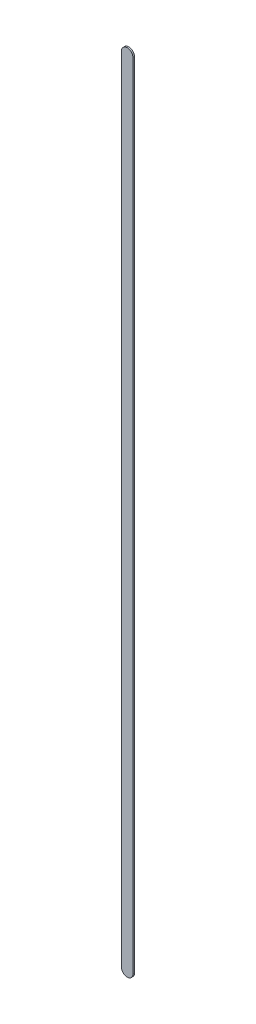
ISO-10303-21;
HEADER;
FILE_DESCRIPTION(('STEP AP214'),'2;1');
FILE_NAME('part.step','',(''),(''),'','','');
FILE_SCHEMA(('AUTOMOTIVE_DESIGN { 1 0 10303 214 1 1 1 1 }'));
ENDSEC;
DATA;
#1=APPLICATION_CONTEXT('core data for automotive mechanical design processes');
#2=APPLICATION_PROTOCOL_DEFINITION('international standard','automotive_design',2000,#1);
#3=PRODUCT_CONTEXT('',#1,'mechanical');
#4=PRODUCT('Part','Part','',(#3));
#5=PRODUCT_RELATED_PRODUCT_CATEGORY('part','',(#4));
#6=PRODUCT_DEFINITION_FORMATION('','',#4);
#7=PRODUCT_DEFINITION_CONTEXT('part definition',#1,'design');
#8=PRODUCT_DEFINITION('design','',#6,#7);
#9=PRODUCT_DEFINITION_SHAPE('','',#8);
#10=(LENGTH_UNIT() NAMED_UNIT(*) SI_UNIT(.MILLI.,.METRE.));
#11=(NAMED_UNIT(*) PLANE_ANGLE_UNIT() SI_UNIT($,.RADIAN.));
#12=(NAMED_UNIT(*) SI_UNIT($,.STERADIAN.) SOLID_ANGLE_UNIT());
#13=UNCERTAINTY_MEASURE_WITH_UNIT(LENGTH_MEASURE(1.E-05),#10,'distance_accuracy_value','');
#14=(GEOMETRIC_REPRESENTATION_CONTEXT(3) GLOBAL_UNCERTAINTY_ASSIGNED_CONTEXT((#13)) GLOBAL_UNIT_ASSIGNED_CONTEXT((#10,
#11,#12)) REPRESENTATION_CONTEXT('',''));
#15=CARTESIAN_POINT('',(0.,0.,0.));
#16=DIRECTION('',(0.,0.,1.));
#17=DIRECTION('',(1.,0.,0.));
#18=AXIS2_PLACEMENT_3D('',#15,#16,#17);
#19=CARTESIAN_POINT('',(75.64397368,76.18697234,0.));
#20=DIRECTION('',(-1.,0.,0.));
#21=DIRECTION('',(0.,1.,0.));
#22=AXIS2_PLACEMENT_3D('',#19,#20,#21);
#23=PLANE('',#22);
#24=DIRECTION('',(0.,1.,0.));
#25=VECTOR('',#24,1.);
#26=CARTESIAN_POINT('',(75.64397368,76.18697234,0.03556));
#27=LINE('',#26,#25);
#28=CARTESIAN_POINT('',(75.64397368,76.18697234,0.03556));
#29=VERTEX_POINT('',#28);
#30=CARTESIAN_POINT('',(75.64397368,93.7869727,0.03556));
#31=VERTEX_POINT('',#30);
#32=EDGE_CURVE('E11',#29,#31,#27,.T.);
#33=ORIENTED_EDGE('',*,*,#32,.F.);
#34=DIRECTION('',(0.,0.,1.));
#35=VECTOR('',#34,1.);
#36=CARTESIAN_POINT('',(75.64397368,76.18697234,0.));
#37=LINE('',#36,#35);
#38=CARTESIAN_POINT('',(75.64397368,76.18697234,0.));
#39=VERTEX_POINT('',#38);
#40=EDGE_CURVE('E24',#39,#29,#37,.T.);
#41=ORIENTED_EDGE('',*,*,#40,.F.);
#42=DIRECTION('',(0.,1.,0.));
#43=VECTOR('',#42,1.);
#44=CARTESIAN_POINT('',(75.64397368,76.18697234,0.));
#45=LINE('',#44,#43);
#46=CARTESIAN_POINT('',(75.64397368,93.7869727,0.));
#47=VERTEX_POINT('',#46);
#48=EDGE_CURVE('E75',#39,#47,#45,.T.);
#49=ORIENTED_EDGE('',*,*,#48,.T.);
#50=DIRECTION('',(0.,0.,1.));
#51=VECTOR('',#50,1.);
#52=CARTESIAN_POINT('',(75.64397368,93.7869727,0.));
#53=LINE('',#52,#51);
#54=EDGE_CURVE('E37',#47,#31,#53,.T.);
#55=ORIENTED_EDGE('',*,*,#54,.T.);
#56=EDGE_LOOP('',(#33,#41,#49,#55));
#57=FACE_BOUND('',#56,.T.);
#58=ADVANCED_FACE('F17',(#57),#23,.F.);
#59=CARTESIAN_POINT('',(75.51697368,93.7869727,0.));
#60=DIRECTION('',(0.,0.,-1.));
#61=DIRECTION('',(1.,-1.11896493820492E-13,0.));
#62=AXIS2_PLACEMENT_3D('',#59,#60,#61);
#63=CYLINDRICAL_SURFACE('',#62,0.127);
#64=CARTESIAN_POINT('',(75.51697368,93.7869727,0.03556));
#65=DIRECTION('',(0.,0.,1.));
#66=DIRECTION('',(1.,-1.11896493820492E-13,0.));
#67=AXIS2_PLACEMENT_3D('',#64,#65,#66);
#68=CIRCLE('',#67,0.127);
#69=CARTESIAN_POINT('',(75.38997368,93.7869727,0.03556));
#70=VERTEX_POINT('',#69);
#71=EDGE_CURVE('E83',#31,#70,#68,.T.);
#72=ORIENTED_EDGE('',*,*,#71,.F.);
#73=ORIENTED_EDGE('',*,*,#54,.F.);
#74=CARTESIAN_POINT('',(75.51697368,93.7869727,0.));
#75=DIRECTION('',(0.,0.,1.));
#76=DIRECTION('',(1.,-1.11896493820492E-13,0.));
#77=AXIS2_PLACEMENT_3D('',#74,#75,#76);
#78=CIRCLE('',#77,0.127);
#79=CARTESIAN_POINT('',(75.38997368,93.7869727,0.));
#80=VERTEX_POINT('',#79);
#81=EDGE_CURVE('E81',#47,#80,#78,.T.);
#82=ORIENTED_EDGE('',*,*,#81,.T.);
#83=DIRECTION('',(0.,0.,1.));
#84=VECTOR('',#83,1.);
#85=CARTESIAN_POINT('',(75.38997368,93.7869727,0.));
#86=LINE('',#85,#84);
#87=EDGE_CURVE('E67',#80,#70,#86,.T.);
#88=ORIENTED_EDGE('',*,*,#87,.T.);
#89=EDGE_LOOP('',(#72,#73,#82,#88));
#90=FACE_BOUND('',#89,.T.);
#91=ADVANCED_FACE('F89',(#90),#63,.T.);
#92=CARTESIAN_POINT('',(75.38997368,93.7869727,0.));
#93=DIRECTION('',(1.,0.,0.));
#94=DIRECTION('',(0.,-1.,0.));
#95=AXIS2_PLACEMENT_3D('',#92,#93,#94);
#96=PLANE('',#95);
#97=DIRECTION('',(0.,-1.,0.));
#98=VECTOR('',#97,1.);
#99=CARTESIAN_POINT('',(75.38997368,93.7869727,0.03556));
#100=LINE('',#99,#98);
#101=CARTESIAN_POINT('',(75.38997368,76.18697234,0.03556));
#102=VERTEX_POINT('',#101);
#103=EDGE_CURVE('E71',#70,#102,#100,.T.);
#104=ORIENTED_EDGE('',*,*,#103,.F.);
#105=ORIENTED_EDGE('',*,*,#87,.F.);
#106=DIRECTION('',(0.,-1.,0.));
#107=VECTOR('',#106,1.);
#108=CARTESIAN_POINT('',(75.38997368,93.7869727,0.));
#109=LINE('',#108,#107);
#110=CARTESIAN_POINT('',(75.38997368,76.18697234,0.));
#111=VERTEX_POINT('',#110);
#112=EDGE_CURVE('E63',#80,#111,#109,.T.);
#113=ORIENTED_EDGE('',*,*,#112,.T.);
#114=DIRECTION('',(0.,0.,1.));
#115=VECTOR('',#114,1.);
#116=CARTESIAN_POINT('',(75.38997368,76.18697234,0.));
#117=LINE('',#116,#115);
#118=EDGE_CURVE('E53',#111,#102,#117,.T.);
#119=ORIENTED_EDGE('',*,*,#118,.T.);
#120=EDGE_LOOP('',(#104,#105,#113,#119));
#121=FACE_BOUND('',#120,.T.);
#122=ADVANCED_FACE('F66',(#121),#96,.F.);
#123=CARTESIAN_POINT('',(75.51697368,76.18697234,0.));
#124=DIRECTION('',(0.,0.,-1.));
#125=DIRECTION('',(-1.,-1.1189649382048E-13,0.));
#126=AXIS2_PLACEMENT_3D('',#123,#124,#125);
#127=CYLINDRICAL_SURFACE('',#126,0.127000000000005);
#128=CARTESIAN_POINT('',(75.51697368,76.18697234,0.03556));
#129=DIRECTION('',(0.,0.,1.));
#130=DIRECTION('',(-1.,-1.1189649382048E-13,0.));
#131=AXIS2_PLACEMENT_3D('',#128,#129,#130);
#132=CIRCLE('',#131,0.127000000000005);
#133=EDGE_CURVE('E59',#102,#29,#132,.T.);
#134=ORIENTED_EDGE('',*,*,#133,.F.);
#135=ORIENTED_EDGE('',*,*,#118,.F.);
#136=CARTESIAN_POINT('',(75.51697368,76.18697234,0.));
#137=DIRECTION('',(0.,0.,1.));
#138=DIRECTION('',(-1.,-1.1189649382048E-13,0.));
#139=AXIS2_PLACEMENT_3D('',#136,#137,#138);
#140=CIRCLE('',#139,0.127000000000005);
#141=EDGE_CURVE('E57',#111,#39,#140,.T.);
#142=ORIENTED_EDGE('',*,*,#141,.T.);
#143=ORIENTED_EDGE('',*,*,#40,.T.);
#144=EDGE_LOOP('',(#134,#135,#142,#143));
#145=FACE_BOUND('',#144,.T.);
#146=ADVANCED_FACE('F55',(#145),#127,.T.);
#147=CARTESIAN_POINT('',(75.64397368,76.18697234,0.));
#148=DIRECTION('',(0.,0.,-1.));
#149=DIRECTION('',(-1.,0.,0.));
#150=AXIS2_PLACEMENT_3D('',#147,#148,#149);
#151=PLANE('',#150);
#152=ORIENTED_EDGE('',*,*,#141,.F.);
#153=ORIENTED_EDGE('',*,*,#112,.F.);
#154=ORIENTED_EDGE('',*,*,#81,.F.);
#155=ORIENTED_EDGE('',*,*,#48,.F.);
#156=EDGE_LOOP('',(#152,#153,#154,#155));
#157=FACE_BOUND('',#156,.T.);
#158=ADVANCED_FACE('F74',(#157),#151,.T.);
#159=CARTESIAN_POINT('',(75.64397368,76.18697234,0.03556));
#160=DIRECTION('',(0.,0.,-1.));
#161=DIRECTION('',(-1.,0.,0.));
#162=AXIS2_PLACEMENT_3D('',#159,#160,#161);
#163=PLANE('',#162);
#164=ORIENTED_EDGE('',*,*,#32,.T.);
#165=ORIENTED_EDGE('',*,*,#71,.T.);
#166=ORIENTED_EDGE('',*,*,#103,.T.);
#167=ORIENTED_EDGE('',*,*,#133,.T.);
#168=EDGE_LOOP('',(#164,#165,#166,#167));
#169=FACE_BOUND('',#168,.T.);
#170=ADVANCED_FACE('F91',(#169),#163,.F.);
#171=CLOSED_SHELL('',(#58,#91,#122,#146,#158,#170));
#172=MANIFOLD_SOLID_BREP('B1',#171);
#173=ADVANCED_BREP_SHAPE_REPRESENTATION('',(#18,#172),#14);
#174=SHAPE_DEFINITION_REPRESENTATION(#9,#173);
ENDSEC;
END-ISO-10303-21;
